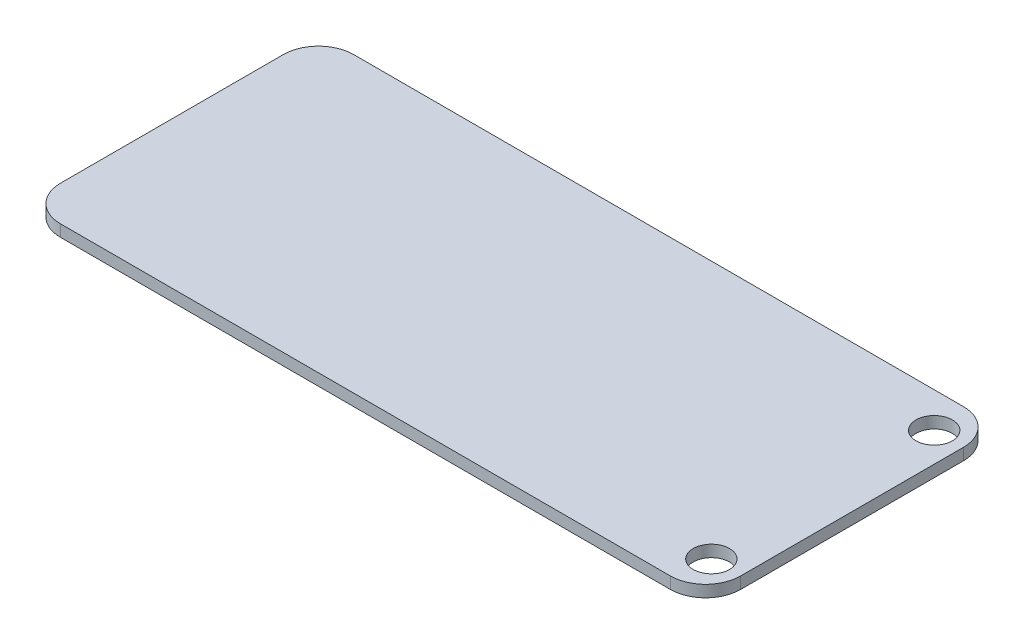
ISO-10303-21;
HEADER;
FILE_DESCRIPTION(('STEP AP214'),'2;1');
FILE_NAME('part.step','',(''),(''),'','','');
FILE_SCHEMA(('AUTOMOTIVE_DESIGN { 1 0 10303 214 1 1 1 1 }'));
ENDSEC;
DATA;
#1=APPLICATION_CONTEXT('core data for automotive mechanical design processes');
#2=APPLICATION_PROTOCOL_DEFINITION('international standard','automotive_design',2000,#1);
#3=PRODUCT_CONTEXT('',#1,'mechanical');
#4=PRODUCT('Part','Part','',(#3));
#5=PRODUCT_RELATED_PRODUCT_CATEGORY('part','',(#4));
#6=PRODUCT_DEFINITION_FORMATION('','',#4);
#7=PRODUCT_DEFINITION_CONTEXT('part definition',#1,'design');
#8=PRODUCT_DEFINITION('design','',#6,#7);
#9=PRODUCT_DEFINITION_SHAPE('','',#8);
#10=(LENGTH_UNIT() NAMED_UNIT(*) SI_UNIT(.MILLI.,.METRE.));
#11=(NAMED_UNIT(*) PLANE_ANGLE_UNIT() SI_UNIT($,.RADIAN.));
#12=(NAMED_UNIT(*) SI_UNIT($,.STERADIAN.) SOLID_ANGLE_UNIT());
#13=UNCERTAINTY_MEASURE_WITH_UNIT(LENGTH_MEASURE(1.E-05),#10,'distance_accuracy_value','');
#14=(GEOMETRIC_REPRESENTATION_CONTEXT(3) GLOBAL_UNCERTAINTY_ASSIGNED_CONTEXT((#13)) GLOBAL_UNIT_ASSIGNED_CONTEXT((#10,
#11,#12)) REPRESENTATION_CONTEXT('',''));
#15=CARTESIAN_POINT('',(0.,0.,0.));
#16=DIRECTION('',(0.,0.,1.));
#17=DIRECTION('',(1.,0.,0.));
#18=AXIS2_PLACEMENT_3D('',#15,#16,#17);
#19=CARTESIAN_POINT('',(29.,1.,-12.5));
#20=DIRECTION('',(-1.,0.,0.));
#21=DIRECTION('',(0.,0.,1.));
#22=AXIS2_PLACEMENT_3D('',#19,#20,#21);
#23=PLANE('',#22);
#24=DIRECTION('',(0.,0.,-1.));
#25=VECTOR('',#24,1.);
#26=CARTESIAN_POINT('',(29.,0.,-12.5));
#27=LINE('',#26,#25);
#28=CARTESIAN_POINT('',(29.,0.,9.50000000000001));
#29=VERTEX_POINT('',#28);
#30=CARTESIAN_POINT('',(29.,0.,-9.5));
#31=VERTEX_POINT('',#30);
#32=EDGE_CURVE('E196',#29,#31,#27,.T.);
#33=ORIENTED_EDGE('',*,*,#32,.T.);
#34=DIRECTION('',(0.,-1.,0.));
#35=VECTOR('',#34,1.);
#36=CARTESIAN_POINT('',(29.,1.,-9.5));
#37=LINE('',#36,#35);
#38=CARTESIAN_POINT('',(29.,1.,-9.5));
#39=VERTEX_POINT('',#38);
#40=EDGE_CURVE('E12',#31,#39,#37,.F.);
#41=ORIENTED_EDGE('',*,*,#40,.T.);
#42=DIRECTION('',(0.,0.,-1.));
#43=VECTOR('',#42,1.);
#44=CARTESIAN_POINT('',(29.,1.,-12.5));
#45=LINE('',#44,#43);
#46=CARTESIAN_POINT('',(29.,1.,9.50000000000001));
#47=VERTEX_POINT('',#46);
#48=EDGE_CURVE('E134',#47,#39,#45,.T.);
#49=ORIENTED_EDGE('',*,*,#48,.F.);
#50=DIRECTION('',(0.,-1.,0.));
#51=VECTOR('',#50,1.);
#52=CARTESIAN_POINT('',(29.,1.,9.50000000000001));
#53=LINE('',#52,#51);
#54=EDGE_CURVE('E50',#47,#29,#53,.T.);
#55=ORIENTED_EDGE('',*,*,#54,.T.);
#56=EDGE_LOOP('',(#33,#41,#49,#55));
#57=FACE_BOUND('',#56,.T.);
#58=ADVANCED_FACE('F42',(#57),#23,.F.);
#59=CARTESIAN_POINT('',(-29.,1.,-12.5));
#60=DIRECTION('',(0.,0.,1.));
#61=DIRECTION('',(1.,0.,0.));
#62=AXIS2_PLACEMENT_3D('',#59,#60,#61);
#63=PLANE('',#62);
#64=DIRECTION('',(-1.,0.,0.));
#65=VECTOR('',#64,1.);
#66=CARTESIAN_POINT('',(-29.,0.,-12.5));
#67=LINE('',#66,#65);
#68=CARTESIAN_POINT('',(26.,0.,-12.5));
#69=VERTEX_POINT('',#68);
#70=CARTESIAN_POINT('',(-26.,0.,-12.5));
#71=VERTEX_POINT('',#70);
#72=EDGE_CURVE('E140',#69,#71,#67,.T.);
#73=ORIENTED_EDGE('',*,*,#72,.T.);
#74=DIRECTION('',(0.,-1.,0.));
#75=VECTOR('',#74,1.);
#76=CARTESIAN_POINT('',(-26.,1.,-12.5));
#77=LINE('',#76,#75);
#78=CARTESIAN_POINT('',(-26.,1.,-12.5));
#79=VERTEX_POINT('',#78);
#80=EDGE_CURVE('E57',#71,#79,#77,.F.);
#81=ORIENTED_EDGE('',*,*,#80,.T.);
#82=DIRECTION('',(-1.,0.,0.));
#83=VECTOR('',#82,1.);
#84=CARTESIAN_POINT('',(-29.,1.,-12.5));
#85=LINE('',#84,#83);
#86=CARTESIAN_POINT('',(26.,1.,-12.5));
#87=VERTEX_POINT('',#86);
#88=EDGE_CURVE('E138',#87,#79,#85,.T.);
#89=ORIENTED_EDGE('',*,*,#88,.F.);
#90=DIRECTION('',(0.,-1.,0.));
#91=VECTOR('',#90,1.);
#92=CARTESIAN_POINT('',(26.,1.,-12.5));
#93=LINE('',#92,#91);
#94=EDGE_CURVE('E186',#87,#69,#93,.T.);
#95=ORIENTED_EDGE('',*,*,#94,.T.);
#96=EDGE_LOOP('',(#73,#81,#89,#95));
#97=FACE_BOUND('',#96,.T.);
#98=ADVANCED_FACE('F232',(#97),#63,.F.);
#99=CARTESIAN_POINT('',(-29.,1.,-12.5));
#100=DIRECTION('',(1.,0.,0.));
#101=DIRECTION('',(0.,0.,-1.));
#102=AXIS2_PLACEMENT_3D('',#99,#100,#101);
#103=PLANE('',#102);
#104=DIRECTION('',(0.,0.,1.));
#105=VECTOR('',#104,1.);
#106=CARTESIAN_POINT('',(-29.,0.,-12.5));
#107=LINE('',#106,#105);
#108=CARTESIAN_POINT('',(-29.,0.,-9.5));
#109=VERTEX_POINT('',#108);
#110=CARTESIAN_POINT('',(-29.,0.,9.50000000000001));
#111=VERTEX_POINT('',#110);
#112=EDGE_CURVE('E135',#109,#111,#107,.T.);
#113=ORIENTED_EDGE('',*,*,#112,.T.);
#114=DIRECTION('',(0.,-1.,0.));
#115=VECTOR('',#114,1.);
#116=CARTESIAN_POINT('',(-29.,1.,9.50000000000001));
#117=LINE('',#116,#115);
#118=CARTESIAN_POINT('',(-29.,1.,9.50000000000001));
#119=VERTEX_POINT('',#118);
#120=EDGE_CURVE('E113',#111,#119,#117,.F.);
#121=ORIENTED_EDGE('',*,*,#120,.T.);
#122=DIRECTION('',(0.,0.,1.));
#123=VECTOR('',#122,1.);
#124=CARTESIAN_POINT('',(-29.,1.,-12.5));
#125=LINE('',#124,#123);
#126=CARTESIAN_POINT('',(-29.,1.,-9.5));
#127=VERTEX_POINT('',#126);
#128=EDGE_CURVE('E172',#127,#119,#125,.T.);
#129=ORIENTED_EDGE('',*,*,#128,.F.);
#130=DIRECTION('',(0.,-1.,0.));
#131=VECTOR('',#130,1.);
#132=CARTESIAN_POINT('',(-29.,1.,-9.5));
#133=LINE('',#132,#131);
#134=EDGE_CURVE('E118',#127,#109,#133,.T.);
#135=ORIENTED_EDGE('',*,*,#134,.T.);
#136=EDGE_LOOP('',(#113,#121,#129,#135));
#137=FACE_BOUND('',#136,.T.);
#138=ADVANCED_FACE('F229',(#137),#103,.F.);
#139=CARTESIAN_POINT('',(-29.,1.,12.5));
#140=DIRECTION('',(0.,0.,-1.));
#141=DIRECTION('',(-1.,0.,0.));
#142=AXIS2_PLACEMENT_3D('',#139,#140,#141);
#143=PLANE('',#142);
#144=DIRECTION('',(1.,0.,0.));
#145=VECTOR('',#144,1.);
#146=CARTESIAN_POINT('',(-29.,1.,12.5));
#147=LINE('',#146,#145);
#148=CARTESIAN_POINT('',(-26.,1.,12.5));
#149=VERTEX_POINT('',#148);
#150=CARTESIAN_POINT('',(26.,1.,12.5));
#151=VERTEX_POINT('',#150);
#152=EDGE_CURVE('E128',#149,#151,#147,.T.);
#153=ORIENTED_EDGE('',*,*,#152,.F.);
#154=DIRECTION('',(0.,-1.,0.));
#155=VECTOR('',#154,1.);
#156=CARTESIAN_POINT('',(-26.,1.,12.5));
#157=LINE('',#156,#155);
#158=CARTESIAN_POINT('',(-26.,0.,12.5));
#159=VERTEX_POINT('',#158);
#160=EDGE_CURVE('E112',#149,#159,#157,.T.);
#161=ORIENTED_EDGE('',*,*,#160,.T.);
#162=DIRECTION('',(1.,0.,0.));
#163=VECTOR('',#162,1.);
#164=CARTESIAN_POINT('',(-29.,0.,12.5));
#165=LINE('',#164,#163);
#166=CARTESIAN_POINT('',(26.,0.,12.5));
#167=VERTEX_POINT('',#166);
#168=EDGE_CURVE('E125',#159,#167,#165,.T.);
#169=ORIENTED_EDGE('',*,*,#168,.T.);
#170=DIRECTION('',(0.,-1.,0.));
#171=VECTOR('',#170,1.);
#172=CARTESIAN_POINT('',(26.,1.,12.5));
#173=LINE('',#172,#171);
#174=EDGE_CURVE('E130',#167,#151,#173,.F.);
#175=ORIENTED_EDGE('',*,*,#174,.T.);
#176=EDGE_LOOP('',(#153,#161,#169,#175));
#177=FACE_BOUND('',#176,.T.);
#178=ADVANCED_FACE('F124',(#177),#143,.F.);
#179=CARTESIAN_POINT('',(0.,1.,0.));
#180=DIRECTION('',(0.,1.,0.));
#181=DIRECTION('',(0.,0.,1.));
#182=AXIS2_PLACEMENT_3D('',#179,#180,#181);
#183=PLANE('',#182);
#184=CARTESIAN_POINT('',(26.5,1.,-9.5));
#185=DIRECTION('',(0.,1.,0.));
#186=DIRECTION('',(0.,0.,1.));
#187=AXIS2_PLACEMENT_3D('',#184,#185,#186);
#188=CIRCLE('',#187,1.55);
#189=CARTESIAN_POINT('',(26.5,1.,-7.95));
#190=VERTEX_POINT('',#189);
#191=EDGE_CURVE('E203',#190,#190,#188,.T.);
#192=ORIENTED_EDGE('',*,*,#191,.F.);
#193=EDGE_LOOP('',(#192));
#194=FACE_BOUND('',#193,.T.);
#195=CARTESIAN_POINT('',(26.5,1.,9.5));
#196=DIRECTION('',(0.,1.,0.));
#197=DIRECTION('',(0.,0.,-1.));
#198=AXIS2_PLACEMENT_3D('',#195,#196,#197);
#199=CIRCLE('',#198,1.55);
#200=CARTESIAN_POINT('',(26.5,1.,7.95));
#201=VERTEX_POINT('',#200);
#202=EDGE_CURVE('E166',#201,#201,#199,.T.);
#203=ORIENTED_EDGE('',*,*,#202,.F.);
#204=EDGE_LOOP('',(#203));
#205=FACE_BOUND('',#204,.T.);
#206=ORIENTED_EDGE('',*,*,#128,.T.);
#207=CARTESIAN_POINT('',(-26.,1.,9.50000000000001));
#208=DIRECTION('',(0.,1.,0.));
#209=DIRECTION('',(0.,0.,1.));
#210=AXIS2_PLACEMENT_3D('',#207,#208,#209);
#211=CIRCLE('',#210,3.);
#212=EDGE_CURVE('E182',#119,#149,#211,.T.);
#213=ORIENTED_EDGE('',*,*,#212,.T.);
#214=ORIENTED_EDGE('',*,*,#152,.T.);
#215=CARTESIAN_POINT('',(26.,1.,9.50000000000001));
#216=DIRECTION('',(0.,1.,0.));
#217=DIRECTION('',(0.,0.,1.));
#218=AXIS2_PLACEMENT_3D('',#215,#216,#217);
#219=CIRCLE('',#218,3.);
#220=EDGE_CURVE('E152',#151,#47,#219,.T.);
#221=ORIENTED_EDGE('',*,*,#220,.T.);
#222=ORIENTED_EDGE('',*,*,#48,.T.);
#223=CARTESIAN_POINT('',(26.,1.,-9.5));
#224=DIRECTION('',(0.,1.,0.));
#225=DIRECTION('',(0.,0.,1.));
#226=AXIS2_PLACEMENT_3D('',#223,#224,#225);
#227=CIRCLE('',#226,3.);
#228=EDGE_CURVE('E64',#39,#87,#227,.T.);
#229=ORIENTED_EDGE('',*,*,#228,.T.);
#230=ORIENTED_EDGE('',*,*,#88,.T.);
#231=CARTESIAN_POINT('',(-26.,1.,-9.5));
#232=DIRECTION('',(0.,1.,0.));
#233=DIRECTION('',(0.,0.,1.));
#234=AXIS2_PLACEMENT_3D('',#231,#232,#233);
#235=CIRCLE('',#234,3.);
#236=EDGE_CURVE('E187',#79,#127,#235,.T.);
#237=ORIENTED_EDGE('',*,*,#236,.T.);
#238=EDGE_LOOP('',(#206,#213,#214,#221,#222,#229,#230,#237));
#239=FACE_BOUND('',#238,.T.);
#240=ADVANCED_FACE('F221',(#194,#205,#239),#183,.T.);
#241=CARTESIAN_POINT('',(0.,0.,0.));
#242=DIRECTION('',(0.,1.,0.));
#243=DIRECTION('',(0.,0.,1.));
#244=AXIS2_PLACEMENT_3D('',#241,#242,#243);
#245=PLANE('',#244);
#246=CARTESIAN_POINT('',(26.5,0.,-9.5));
#247=DIRECTION('',(0.,1.,0.));
#248=DIRECTION('',(0.,0.,1.));
#249=AXIS2_PLACEMENT_3D('',#246,#247,#248);
#250=CIRCLE('',#249,1.55);
#251=CARTESIAN_POINT('',(26.5,0.,-7.95));
#252=VERTEX_POINT('',#251);
#253=EDGE_CURVE('E201',#252,#252,#250,.T.);
#254=ORIENTED_EDGE('',*,*,#253,.T.);
#255=EDGE_LOOP('',(#254));
#256=FACE_BOUND('',#255,.T.);
#257=CARTESIAN_POINT('',(26.5,0.,9.5));
#258=DIRECTION('',(0.,1.,0.));
#259=DIRECTION('',(0.,0.,-1.));
#260=AXIS2_PLACEMENT_3D('',#257,#258,#259);
#261=CIRCLE('',#260,1.55);
#262=CARTESIAN_POINT('',(26.5,0.,7.95));
#263=VERTEX_POINT('',#262);
#264=EDGE_CURVE('E209',#263,#263,#261,.T.);
#265=ORIENTED_EDGE('',*,*,#264,.T.);
#266=EDGE_LOOP('',(#265));
#267=FACE_BOUND('',#266,.T.);
#268=ORIENTED_EDGE('',*,*,#168,.F.);
#269=CARTESIAN_POINT('',(-26.,0.,9.50000000000001));
#270=DIRECTION('',(0.,1.,0.));
#271=DIRECTION('',(0.,0.,1.));
#272=AXIS2_PLACEMENT_3D('',#269,#270,#271);
#273=CIRCLE('',#272,3.);
#274=EDGE_CURVE('E108',#159,#111,#273,.F.);
#275=ORIENTED_EDGE('',*,*,#274,.T.);
#276=ORIENTED_EDGE('',*,*,#112,.F.);
#277=CARTESIAN_POINT('',(-26.,0.,-9.5));
#278=DIRECTION('',(0.,1.,0.));
#279=DIRECTION('',(0.,0.,1.));
#280=AXIS2_PLACEMENT_3D('',#277,#278,#279);
#281=CIRCLE('',#280,3.);
#282=EDGE_CURVE('E119',#109,#71,#281,.F.);
#283=ORIENTED_EDGE('',*,*,#282,.T.);
#284=ORIENTED_EDGE('',*,*,#72,.F.);
#285=CARTESIAN_POINT('',(26.,0.,-9.5));
#286=DIRECTION('',(0.,1.,0.));
#287=DIRECTION('',(0.,0.,1.));
#288=AXIS2_PLACEMENT_3D('',#285,#286,#287);
#289=CIRCLE('',#288,3.);
#290=EDGE_CURVE('E146',#69,#31,#289,.F.);
#291=ORIENTED_EDGE('',*,*,#290,.T.);
#292=ORIENTED_EDGE('',*,*,#32,.F.);
#293=CARTESIAN_POINT('',(26.,0.,9.50000000000001));
#294=DIRECTION('',(0.,1.,0.));
#295=DIRECTION('',(0.,0.,1.));
#296=AXIS2_PLACEMENT_3D('',#293,#294,#295);
#297=CIRCLE('',#296,3.);
#298=EDGE_CURVE('E129',#29,#167,#297,.F.);
#299=ORIENTED_EDGE('',*,*,#298,.T.);
#300=EDGE_LOOP('',(#268,#275,#276,#283,#284,#291,#292,#299));
#301=FACE_BOUND('',#300,.T.);
#302=ADVANCED_FACE('F132',(#256,#267,#301),#245,.F.);
#303=CARTESIAN_POINT('',(26.5,0.,9.5));
#304=DIRECTION('',(0.,1.,0.));
#305=DIRECTION('',(0.,0.,1.));
#306=AXIS2_PLACEMENT_3D('',#303,#304,#305);
#307=CYLINDRICAL_SURFACE('',#306,1.55);
#308=ORIENTED_EDGE('',*,*,#264,.F.);
#309=EDGE_LOOP('',(#308));
#310=FACE_BOUND('',#309,.T.);
#311=ORIENTED_EDGE('',*,*,#202,.T.);
#312=EDGE_LOOP('',(#311));
#313=FACE_BOUND('',#312,.T.);
#314=ADVANCED_FACE('F219',(#310,#313),#307,.F.);
#315=CARTESIAN_POINT('',(26.5,0.,-9.5));
#316=DIRECTION('',(0.,1.,0.));
#317=DIRECTION('',(0.,0.,1.));
#318=AXIS2_PLACEMENT_3D('',#315,#316,#317);
#319=CYLINDRICAL_SURFACE('',#318,1.55);
#320=ORIENTED_EDGE('',*,*,#253,.F.);
#321=EDGE_LOOP('',(#320));
#322=FACE_BOUND('',#321,.T.);
#323=ORIENTED_EDGE('',*,*,#191,.T.);
#324=EDGE_LOOP('',(#323));
#325=FACE_BOUND('',#324,.T.);
#326=ADVANCED_FACE('F250',(#322,#325),#319,.F.);
#327=CARTESIAN_POINT('',(-26.,1.,9.50000000000001));
#328=DIRECTION('',(0.,-1.,0.));
#329=DIRECTION('',(0.,0.,-1.));
#330=AXIS2_PLACEMENT_3D('',#327,#328,#329);
#331=CYLINDRICAL_SURFACE('',#330,3.);
#332=ORIENTED_EDGE('',*,*,#212,.F.);
#333=ORIENTED_EDGE('',*,*,#120,.F.);
#334=ORIENTED_EDGE('',*,*,#274,.F.);
#335=ORIENTED_EDGE('',*,*,#160,.F.);
#336=EDGE_LOOP('',(#332,#333,#334,#335));
#337=FACE_BOUND('',#336,.T.);
#338=ADVANCED_FACE('F111',(#337),#331,.T.);
#339=CARTESIAN_POINT('',(-26.,1.,-9.5));
#340=DIRECTION('',(0.,-1.,0.));
#341=DIRECTION('',(0.,0.,-1.));
#342=AXIS2_PLACEMENT_3D('',#339,#340,#341);
#343=CYLINDRICAL_SURFACE('',#342,3.);
#344=ORIENTED_EDGE('',*,*,#236,.F.);
#345=ORIENTED_EDGE('',*,*,#80,.F.);
#346=ORIENTED_EDGE('',*,*,#282,.F.);
#347=ORIENTED_EDGE('',*,*,#134,.F.);
#348=EDGE_LOOP('',(#344,#345,#346,#347));
#349=FACE_BOUND('',#348,.T.);
#350=ADVANCED_FACE('F231',(#349),#343,.T.);
#351=CARTESIAN_POINT('',(26.,1.,-9.5));
#352=DIRECTION('',(0.,-1.,0.));
#353=DIRECTION('',(0.,0.,-1.));
#354=AXIS2_PLACEMENT_3D('',#351,#352,#353);
#355=CYLINDRICAL_SURFACE('',#354,3.);
#356=ORIENTED_EDGE('',*,*,#228,.F.);
#357=ORIENTED_EDGE('',*,*,#40,.F.);
#358=ORIENTED_EDGE('',*,*,#290,.F.);
#359=ORIENTED_EDGE('',*,*,#94,.F.);
#360=EDGE_LOOP('',(#356,#357,#358,#359));
#361=FACE_BOUND('',#360,.T.);
#362=ADVANCED_FACE('F235',(#361),#355,.T.);
#363=CARTESIAN_POINT('',(26.,1.,9.50000000000001));
#364=DIRECTION('',(0.,-1.,0.));
#365=DIRECTION('',(0.,0.,-1.));
#366=AXIS2_PLACEMENT_3D('',#363,#364,#365);
#367=CYLINDRICAL_SURFACE('',#366,3.);
#368=ORIENTED_EDGE('',*,*,#220,.F.);
#369=ORIENTED_EDGE('',*,*,#174,.F.);
#370=ORIENTED_EDGE('',*,*,#298,.F.);
#371=ORIENTED_EDGE('',*,*,#54,.F.);
#372=EDGE_LOOP('',(#368,#369,#370,#371));
#373=FACE_BOUND('',#372,.T.);
#374=ADVANCED_FACE('F44',(#373),#367,.T.);
#375=CLOSED_SHELL('',(#58,#98,#138,#178,#240,#302,#314,#326,#338,#350,#362,#374));
#376=MANIFOLD_SOLID_BREP('B2',#375);
#377=ADVANCED_BREP_SHAPE_REPRESENTATION('',(#18,#376),#14);
#378=SHAPE_DEFINITION_REPRESENTATION(#9,#377);
ENDSEC;
END-ISO-10303-21;
